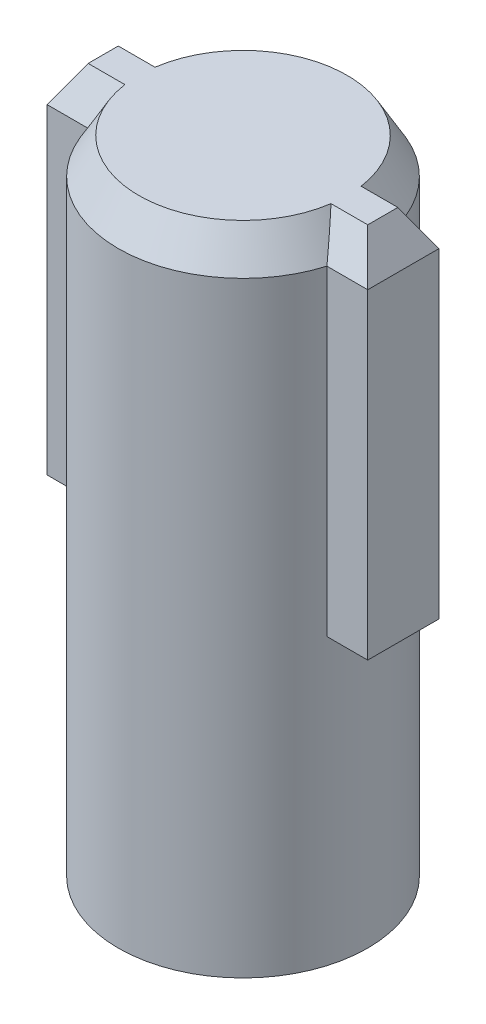
ISO-10303-21;
HEADER;
FILE_DESCRIPTION(('STEP AP214'),'2;1');
FILE_NAME('part.step','',(''),(''),'','','');
FILE_SCHEMA(('AUTOMOTIVE_DESIGN { 1 0 10303 214 1 1 1 1 }'));
ENDSEC;
DATA;
#1=APPLICATION_CONTEXT('core data for automotive mechanical design processes');
#2=APPLICATION_PROTOCOL_DEFINITION('international standard','automotive_design',2000,#1);
#3=PRODUCT_CONTEXT('',#1,'mechanical');
#4=PRODUCT('Part','Part','',(#3));
#5=PRODUCT_RELATED_PRODUCT_CATEGORY('part','',(#4));
#6=PRODUCT_DEFINITION_FORMATION('','',#4);
#7=PRODUCT_DEFINITION_CONTEXT('part definition',#1,'design');
#8=PRODUCT_DEFINITION('design','',#6,#7);
#9=PRODUCT_DEFINITION_SHAPE('','',#8);
#10=(LENGTH_UNIT() NAMED_UNIT(*) SI_UNIT(.MILLI.,.METRE.));
#11=(NAMED_UNIT(*) PLANE_ANGLE_UNIT() SI_UNIT($,.RADIAN.));
#12=(NAMED_UNIT(*) SI_UNIT($,.STERADIAN.) SOLID_ANGLE_UNIT());
#13=UNCERTAINTY_MEASURE_WITH_UNIT(LENGTH_MEASURE(1.E-05),#10,'distance_accuracy_value','');
#14=(GEOMETRIC_REPRESENTATION_CONTEXT(3) GLOBAL_UNCERTAINTY_ASSIGNED_CONTEXT((#13)) GLOBAL_UNIT_ASSIGNED_CONTEXT((#10,
#11,#12)) REPRESENTATION_CONTEXT('',''));
#15=CARTESIAN_POINT('',(0.,0.,0.));
#16=DIRECTION('',(0.,0.,1.));
#17=DIRECTION('',(1.,0.,0.));
#18=AXIS2_PLACEMENT_3D('',#15,#16,#17);
#19=CARTESIAN_POINT('',(0.,18.,0.));
#20=DIRECTION('',(0.,-1.,0.));
#21=DIRECTION('',(0.,0.,-1.));
#22=AXIS2_PLACEMENT_3D('',#19,#20,#21);
#23=CYLINDRICAL_SURFACE('',#22,3.5);
#24=DIRECTION('',(0.,-1.,0.));
#25=VECTOR('',#24,1.);
#26=CARTESIAN_POINT('',(-3.35410196624968,18.,-1.));
#27=LINE('',#26,#25);
#28=CARTESIAN_POINT('',(-3.35410196624968,12.,-1.));
#29=VERTEX_POINT('',#28);
#30=CARTESIAN_POINT('',(-3.35410196624968,17.,-1.));
#31=VERTEX_POINT('',#30);
#32=EDGE_CURVE('E186',#29,#31,#27,.F.);
#33=ORIENTED_EDGE('',*,*,#32,.T.);
#34=CARTESIAN_POINT('',(0.,17.,0.));
#35=DIRECTION('',(0.,1.,0.));
#36=DIRECTION('',(0.,0.,1.));
#37=AXIS2_PLACEMENT_3D('',#34,#35,#36);
#38=CIRCLE('',#37,3.5);
#39=CARTESIAN_POINT('',(3.35410196624968,17.,-1.));
#40=VERTEX_POINT('',#39);
#41=EDGE_CURVE('E219',#31,#40,#38,.F.);
#42=ORIENTED_EDGE('',*,*,#41,.T.);
#43=DIRECTION('',(0.,-1.,0.));
#44=VECTOR('',#43,1.);
#45=CARTESIAN_POINT('',(3.35410196624968,18.,-1.));
#46=LINE('',#45,#44);
#47=CARTESIAN_POINT('',(3.35410196624968,12.,-0.999999999999999));
#48=VERTEX_POINT('',#47);
#49=EDGE_CURVE('E189',#40,#48,#46,.T.);
#50=ORIENTED_EDGE('',*,*,#49,.T.);
#51=CARTESIAN_POINT('',(0.,12.,0.));
#52=DIRECTION('',(0.,-1.,0.));
#53=DIRECTION('',(0.,0.,-1.));
#54=AXIS2_PLACEMENT_3D('',#51,#52,#53);
#55=CIRCLE('',#54,3.5);
#56=EDGE_CURVE('E146',#29,#48,#55,.T.);
#57=ORIENTED_EDGE('',*,*,#56,.F.);
#58=EDGE_LOOP('',(#33,#42,#50,#57));
#59=FACE_BOUND('',#58,.T.);
#60=ADVANCED_FACE('F34',(#59),#23,.T.);
#61=DIRECTION('',(0.,-1.,0.));
#62=VECTOR('',#61,1.);
#63=CARTESIAN_POINT('',(3.35410196624968,18.,1.));
#64=LINE('',#63,#62);
#65=CARTESIAN_POINT('',(3.35410196624968,8.,1.));
#66=VERTEX_POINT('',#65);
#67=CARTESIAN_POINT('',(3.35410196624968,17.,1.));
#68=VERTEX_POINT('',#67);
#69=EDGE_CURVE('E180',#66,#68,#64,.F.);
#70=ORIENTED_EDGE('',*,*,#69,.T.);
#71=CARTESIAN_POINT('',(0.,17.,0.));
#72=DIRECTION('',(0.,1.,0.));
#73=DIRECTION('',(0.,0.,1.));
#74=AXIS2_PLACEMENT_3D('',#71,#72,#73);
#75=CIRCLE('',#74,3.5);
#76=CARTESIAN_POINT('',(-3.35410196624968,17.,1.));
#77=VERTEX_POINT('',#76);
#78=EDGE_CURVE('E11',#68,#77,#75,.F.);
#79=ORIENTED_EDGE('',*,*,#78,.T.);
#80=DIRECTION('',(0.,-1.,0.));
#81=VECTOR('',#80,1.);
#82=CARTESIAN_POINT('',(-3.35410196624968,18.,1.));
#83=LINE('',#82,#81);
#84=CARTESIAN_POINT('',(-3.35410196624968,8.,1.));
#85=VERTEX_POINT('',#84);
#86=EDGE_CURVE('E184',#77,#85,#83,.T.);
#87=ORIENTED_EDGE('',*,*,#86,.T.);
#88=CARTESIAN_POINT('',(0.,8.,0.));
#89=DIRECTION('',(0.,-1.,0.));
#90=DIRECTION('',(0.,0.,-1.));
#91=AXIS2_PLACEMENT_3D('',#88,#89,#90);
#92=CIRCLE('',#91,3.5);
#93=CARTESIAN_POINT('',(-3.35410196624968,8.,-1.));
#94=VERTEX_POINT('',#93);
#95=EDGE_CURVE('E143',#85,#94,#92,.T.);
#96=ORIENTED_EDGE('',*,*,#95,.T.);
#97=CARTESIAN_POINT('',(0.,8.,0.));
#98=DIRECTION('',(0.,-1.,0.));
#99=DIRECTION('',(0.,0.,-1.));
#100=AXIS2_PLACEMENT_3D('',#97,#98,#99);
#101=CIRCLE('',#100,3.5);
#102=CARTESIAN_POINT('',(3.35410196624968,8.,-0.999999999999999));
#103=VERTEX_POINT('',#102);
#104=EDGE_CURVE('E136',#94,#103,#101,.T.);
#105=ORIENTED_EDGE('',*,*,#104,.T.);
#106=EDGE_CURVE('E141',#103,#66,#92,.T.);
#107=ORIENTED_EDGE('',*,*,#106,.T.);
#108=EDGE_LOOP('',(#70,#79,#87,#96,#105,#107));
#109=FACE_BOUND('',#108,.T.);
#110=CARTESIAN_POINT('',(0.,0.,0.));
#111=DIRECTION('',(0.,1.,0.));
#112=DIRECTION('',(0.,0.,1.));
#113=AXIS2_PLACEMENT_3D('',#110,#111,#112);
#114=CIRCLE('',#113,3.5);
#115=CARTESIAN_POINT('',(0.,0.,3.5));
#116=VERTEX_POINT('',#115);
#117=EDGE_CURVE('E191',#116,#116,#114,.T.);
#118=ORIENTED_EDGE('',*,*,#117,.T.);
#119=EDGE_LOOP('',(#118));
#120=FACE_BOUND('',#119,.T.);
#121=ADVANCED_FACE('F138',(#109,#120),#23,.T.);
#122=CARTESIAN_POINT('',(0.,18.,0.));
#123=DIRECTION('',(0.,1.,0.));
#124=DIRECTION('',(0.,0.,1.));
#125=AXIS2_PLACEMENT_3D('',#122,#123,#124);
#126=PLANE('',#125);
#127=DIRECTION('',(0.,0.,1.));
#128=VECTOR('',#127,1.);
#129=CARTESIAN_POINT('',(-3.92264973081037,18.,0.));
#130=LINE('',#129,#128);
#131=CARTESIAN_POINT('',(-3.92264973081037,18.,-0.422649730810368));
#132=VERTEX_POINT('',#131);
#133=CARTESIAN_POINT('',(-3.92264973081037,18.,0.422649730810368));
#134=VERTEX_POINT('',#133);
#135=EDGE_CURVE('E205',#132,#134,#130,.T.);
#136=ORIENTED_EDGE('',*,*,#135,.T.);
#137=DIRECTION('',(1.,0.,0.));
#138=VECTOR('',#137,1.);
#139=CARTESIAN_POINT('',(0.,18.,0.422649730810368));
#140=LINE('',#139,#138);
#141=CARTESIAN_POINT('',(-2.891928189643,18.,0.422649730810362));
#142=VERTEX_POINT('',#141);
#143=EDGE_CURVE('E207',#134,#142,#140,.T.);
#144=ORIENTED_EDGE('',*,*,#143,.T.);
#145=CARTESIAN_POINT('',(0.,18.,0.));
#146=DIRECTION('',(0.,1.,0.));
#147=DIRECTION('',(0.,0.,1.));
#148=AXIS2_PLACEMENT_3D('',#145,#146,#147);
#149=CIRCLE('',#148,2.92264973081037);
#150=CARTESIAN_POINT('',(2.891928189643,18.,0.422649730810361));
#151=VERTEX_POINT('',#150);
#152=EDGE_CURVE('E162',#142,#151,#149,.T.);
#153=ORIENTED_EDGE('',*,*,#152,.T.);
#154=DIRECTION('',(1.,0.,0.));
#155=VECTOR('',#154,1.);
#156=CARTESIAN_POINT('',(0.,18.,0.422649730810368));
#157=LINE('',#156,#155);
#158=CARTESIAN_POINT('',(3.92264973081037,18.,0.422649730810367));
#159=VERTEX_POINT('',#158);
#160=EDGE_CURVE('E195',#151,#159,#157,.T.);
#161=ORIENTED_EDGE('',*,*,#160,.T.);
#162=DIRECTION('',(0.,0.,-1.));
#163=VECTOR('',#162,1.);
#164=CARTESIAN_POINT('',(3.92264973081037,18.,0.));
#165=LINE('',#164,#163);
#166=CARTESIAN_POINT('',(3.92264973081037,18.,-0.422649730810369));
#167=VERTEX_POINT('',#166);
#168=EDGE_CURVE('E197',#159,#167,#165,.T.);
#169=ORIENTED_EDGE('',*,*,#168,.T.);
#170=DIRECTION('',(-1.,0.,0.));
#171=VECTOR('',#170,1.);
#172=CARTESIAN_POINT('',(0.,18.,-0.422649730810368));
#173=LINE('',#172,#171);
#174=CARTESIAN_POINT('',(2.891928189643,18.,-0.422649730810369));
#175=VERTEX_POINT('',#174);
#176=EDGE_CURVE('E199',#167,#175,#173,.T.);
#177=ORIENTED_EDGE('',*,*,#176,.T.);
#178=CARTESIAN_POINT('',(0.,18.,0.));
#179=DIRECTION('',(0.,1.,0.));
#180=DIRECTION('',(0.,0.,1.));
#181=AXIS2_PLACEMENT_3D('',#178,#179,#180);
#182=CIRCLE('',#181,2.92264973081037);
#183=CARTESIAN_POINT('',(-2.891928189643,18.,-0.422649730810361));
#184=VERTEX_POINT('',#183);
#185=EDGE_CURVE('E201',#175,#184,#182,.T.);
#186=ORIENTED_EDGE('',*,*,#185,.T.);
#187=DIRECTION('',(-1.,0.,0.));
#188=VECTOR('',#187,1.);
#189=CARTESIAN_POINT('',(0.,18.,-0.422649730810368));
#190=LINE('',#189,#188);
#191=EDGE_CURVE('E203',#184,#132,#190,.T.);
#192=ORIENTED_EDGE('',*,*,#191,.T.);
#193=EDGE_LOOP('',(#136,#144,#153,#161,#169,#177,#186,#192));
#194=FACE_BOUND('',#193,.T.);
#195=ADVANCED_FACE('F284',(#194),#126,.T.);
#196=CARTESIAN_POINT('',(0.,0.,0.));
#197=DIRECTION('',(0.,1.,0.));
#198=DIRECTION('',(0.,0.,1.));
#199=AXIS2_PLACEMENT_3D('',#196,#197,#198);
#200=PLANE('',#199);
#201=ORIENTED_EDGE('',*,*,#117,.F.);
#202=EDGE_LOOP('',(#201));
#203=FACE_BOUND('',#202,.T.);
#204=ADVANCED_FACE('F286',(#203),#200,.F.);
#205=CARTESIAN_POINT('',(-4.5,8.,-1.));
#206=DIRECTION('',(-1.,0.,0.));
#207=DIRECTION('',(0.,0.,1.));
#208=AXIS2_PLACEMENT_3D('',#205,#206,#207);
#209=PLANE('',#208);
#210=DIRECTION('',(0.,1.,0.));
#211=VECTOR('',#210,1.);
#212=CARTESIAN_POINT('',(-4.5,8.,1.));
#213=LINE('',#212,#211);
#214=CARTESIAN_POINT('',(-4.5,8.,1.));
#215=VERTEX_POINT('',#214);
#216=CARTESIAN_POINT('',(-4.5,17.,1.));
#217=VERTEX_POINT('',#216);
#218=EDGE_CURVE('E168',#215,#217,#213,.T.);
#219=ORIENTED_EDGE('',*,*,#218,.T.);
#220=DIRECTION('',(0.,0.,-1.));
#221=VECTOR('',#220,1.);
#222=CARTESIAN_POINT('',(-4.5,17.,-1.));
#223=LINE('',#222,#221);
#224=CARTESIAN_POINT('',(-4.5,17.,-1.));
#225=VERTEX_POINT('',#224);
#226=EDGE_CURVE('E213',#217,#225,#223,.T.);
#227=ORIENTED_EDGE('',*,*,#226,.T.);
#228=DIRECTION('',(0.,1.,0.));
#229=VECTOR('',#228,1.);
#230=CARTESIAN_POINT('',(-4.5,8.,-1.));
#231=LINE('',#230,#229);
#232=CARTESIAN_POINT('',(-4.5,8.,-1.));
#233=VERTEX_POINT('',#232);
#234=EDGE_CURVE('E178',#233,#225,#231,.T.);
#235=ORIENTED_EDGE('',*,*,#234,.F.);
#236=DIRECTION('',(0.,0.,1.));
#237=VECTOR('',#236,1.);
#238=CARTESIAN_POINT('',(-4.5,8.,-1.));
#239=LINE('',#238,#237);
#240=EDGE_CURVE('E322',#233,#215,#239,.T.);
#241=ORIENTED_EDGE('',*,*,#240,.T.);
#242=EDGE_LOOP('',(#219,#227,#235,#241));
#243=FACE_BOUND('',#242,.T.);
#244=ADVANCED_FACE('F289',(#243),#209,.T.);
#245=CARTESIAN_POINT('',(0.,8.,0.));
#246=DIRECTION('',(0.,-1.,0.));
#247=DIRECTION('',(0.,0.,-1.));
#248=AXIS2_PLACEMENT_3D('',#245,#246,#247);
#249=PLANE('',#248);
#250=ORIENTED_EDGE('',*,*,#95,.F.);
#251=DIRECTION('',(1.,0.,0.));
#252=VECTOR('',#251,1.);
#253=CARTESIAN_POINT('',(4.5,8.,0.999999999999999));
#254=LINE('',#253,#252);
#255=EDGE_CURVE('E329',#215,#85,#254,.T.);
#256=ORIENTED_EDGE('',*,*,#255,.F.);
#257=ORIENTED_EDGE('',*,*,#240,.F.);
#258=DIRECTION('',(-1.,0.,0.));
#259=VECTOR('',#258,1.);
#260=CARTESIAN_POINT('',(4.5,8.,-1.));
#261=LINE('',#260,#259);
#262=EDGE_CURVE('E169',#94,#233,#261,.T.);
#263=ORIENTED_EDGE('',*,*,#262,.F.);
#264=EDGE_LOOP('',(#250,#256,#257,#263));
#265=FACE_BOUND('',#264,.T.);
#266=ADVANCED_FACE('F296',(#265),#249,.T.);
#267=CARTESIAN_POINT('',(4.5,8.,0.999999999999999));
#268=DIRECTION('',(0.,0.,1.));
#269=DIRECTION('',(1.,0.,0.));
#270=AXIS2_PLACEMENT_3D('',#267,#268,#269);
#271=PLANE('',#270);
#272=ORIENTED_EDGE('',*,*,#86,.F.);
#273=DIRECTION('',(-1.,0.,0.));
#274=VECTOR('',#273,1.);
#275=CARTESIAN_POINT('',(4.5,17.,0.999999999999999));
#276=LINE('',#275,#274);
#277=EDGE_CURVE('E210',#77,#217,#276,.T.);
#278=ORIENTED_EDGE('',*,*,#277,.T.);
#279=ORIENTED_EDGE('',*,*,#218,.F.);
#280=ORIENTED_EDGE('',*,*,#255,.T.);
#281=EDGE_LOOP('',(#272,#278,#279,#280));
#282=FACE_BOUND('',#281,.T.);
#283=ADVANCED_FACE('F298',(#282),#271,.T.);
#284=ORIENTED_EDGE('',*,*,#106,.F.);
#285=CARTESIAN_POINT('',(4.5,8.,-1.));
#286=VERTEX_POINT('',#285);
#287=EDGE_CURVE('E160',#286,#103,#261,.T.);
#288=ORIENTED_EDGE('',*,*,#287,.F.);
#289=DIRECTION('',(0.,0.,-1.));
#290=VECTOR('',#289,1.);
#291=CARTESIAN_POINT('',(4.5,8.,-1.));
#292=LINE('',#291,#290);
#293=CARTESIAN_POINT('',(4.5,8.,0.999999999999999));
#294=VERTEX_POINT('',#293);
#295=EDGE_CURVE('E174',#294,#286,#292,.T.);
#296=ORIENTED_EDGE('',*,*,#295,.F.);
#297=EDGE_CURVE('E161',#66,#294,#254,.T.);
#298=ORIENTED_EDGE('',*,*,#297,.F.);
#299=EDGE_LOOP('',(#284,#288,#296,#298));
#300=FACE_BOUND('',#299,.T.);
#301=ADVANCED_FACE('F158',(#300),#249,.T.);
#302=CARTESIAN_POINT('',(4.5,8.,-1.));
#303=DIRECTION('',(0.,0.,-1.));
#304=DIRECTION('',(-1.,0.,0.));
#305=AXIS2_PLACEMENT_3D('',#302,#303,#304);
#306=PLANE('',#305);
#307=ORIENTED_EDGE('',*,*,#234,.T.);
#308=DIRECTION('',(1.,0.,0.));
#309=VECTOR('',#308,1.);
#310=CARTESIAN_POINT('',(4.5,17.,-1.));
#311=LINE('',#310,#309);
#312=EDGE_CURVE('E217',#225,#31,#311,.T.);
#313=ORIENTED_EDGE('',*,*,#312,.T.);
#314=ORIENTED_EDGE('',*,*,#32,.F.);
#315=DIRECTION('',(-1.,0.,0.));
#316=VECTOR('',#315,1.);
#317=CARTESIAN_POINT('',(-5.,12.,-1.));
#318=LINE('',#317,#316);
#319=EDGE_CURVE('E147',#48,#29,#318,.T.);
#320=ORIENTED_EDGE('',*,*,#319,.F.);
#321=ORIENTED_EDGE('',*,*,#49,.F.);
#322=DIRECTION('',(1.,0.,0.));
#323=VECTOR('',#322,1.);
#324=CARTESIAN_POINT('',(4.5,17.,-1.));
#325=LINE('',#324,#323);
#326=CARTESIAN_POINT('',(4.5,17.,-1.));
#327=VERTEX_POINT('',#326);
#328=EDGE_CURVE('E215',#40,#327,#325,.T.);
#329=ORIENTED_EDGE('',*,*,#328,.T.);
#330=DIRECTION('',(0.,1.,0.));
#331=VECTOR('',#330,1.);
#332=CARTESIAN_POINT('',(4.5,8.,-1.));
#333=LINE('',#332,#331);
#334=EDGE_CURVE('E166',#286,#327,#333,.T.);
#335=ORIENTED_EDGE('',*,*,#334,.F.);
#336=ORIENTED_EDGE('',*,*,#287,.T.);
#337=DIRECTION('',(-1.,0.,0.));
#338=VECTOR('',#337,1.);
#339=CARTESIAN_POINT('',(-5.,8.,-1.));
#340=LINE('',#339,#338);
#341=EDGE_CURVE('E149',#103,#94,#340,.T.);
#342=ORIENTED_EDGE('',*,*,#341,.T.);
#343=ORIENTED_EDGE('',*,*,#262,.T.);
#344=EDGE_LOOP('',(#307,#313,#314,#320,#321,#329,#335,#336,#342,#343));
#345=FACE_BOUND('',#344,.T.);
#346=ADVANCED_FACE('F165',(#345),#306,.T.);
#347=DIRECTION('',(0.,1.,0.));
#348=VECTOR('',#347,1.);
#349=CARTESIAN_POINT('',(4.5,8.,0.999999999999999));
#350=LINE('',#349,#348);
#351=CARTESIAN_POINT('',(4.5,17.,0.999999999999999));
#352=VERTEX_POINT('',#351);
#353=EDGE_CURVE('E172',#294,#352,#350,.T.);
#354=ORIENTED_EDGE('',*,*,#353,.T.);
#355=DIRECTION('',(-1.,0.,0.));
#356=VECTOR('',#355,1.);
#357=CARTESIAN_POINT('',(4.5,17.,0.999999999999999));
#358=LINE('',#357,#356);
#359=EDGE_CURVE('E48',#352,#68,#358,.T.);
#360=ORIENTED_EDGE('',*,*,#359,.T.);
#361=ORIENTED_EDGE('',*,*,#69,.F.);
#362=ORIENTED_EDGE('',*,*,#297,.T.);
#363=EDGE_LOOP('',(#354,#360,#361,#362));
#364=FACE_BOUND('',#363,.T.);
#365=ADVANCED_FACE('F302',(#364),#271,.T.);
#366=CARTESIAN_POINT('',(4.5,8.,-1.));
#367=DIRECTION('',(1.,0.,0.));
#368=DIRECTION('',(0.,0.,-1.));
#369=AXIS2_PLACEMENT_3D('',#366,#367,#368);
#370=PLANE('',#369);
#371=ORIENTED_EDGE('',*,*,#334,.T.);
#372=DIRECTION('',(0.,0.,1.));
#373=VECTOR('',#372,1.);
#374=CARTESIAN_POINT('',(4.5,17.,-1.));
#375=LINE('',#374,#373);
#376=EDGE_CURVE('E63',#327,#352,#375,.T.);
#377=ORIENTED_EDGE('',*,*,#376,.T.);
#378=ORIENTED_EDGE('',*,*,#353,.F.);
#379=ORIENTED_EDGE('',*,*,#295,.T.);
#380=EDGE_LOOP('',(#371,#377,#378,#379));
#381=FACE_BOUND('',#380,.T.);
#382=ADVANCED_FACE('F303',(#381),#370,.T.);
#383=CARTESIAN_POINT('',(0.,12.,0.));
#384=DIRECTION('',(0.,-1.,0.));
#385=DIRECTION('',(0.,0.,-1.));
#386=AXIS2_PLACEMENT_3D('',#383,#384,#385);
#387=PLANE('',#386);
#388=ORIENTED_EDGE('',*,*,#56,.T.);
#389=ORIENTED_EDGE('',*,*,#319,.T.);
#390=EDGE_LOOP('',(#388,#389));
#391=FACE_BOUND('',#390,.T.);
#392=ADVANCED_FACE('F306',(#391),#387,.T.);
#393=CARTESIAN_POINT('',(0.,8.,0.));
#394=DIRECTION('',(0.,-1.,0.));
#395=DIRECTION('',(0.,0.,-1.));
#396=AXIS2_PLACEMENT_3D('',#393,#394,#395);
#397=PLANE('',#396);
#398=ORIENTED_EDGE('',*,*,#104,.F.);
#399=ORIENTED_EDGE('',*,*,#341,.F.);
#400=EDGE_LOOP('',(#398,#399));
#401=FACE_BOUND('',#400,.T.);
#402=ADVANCED_FACE('F150',(#401),#397,.F.);
#403=CARTESIAN_POINT('',(0.,18.,-0.422649730810368));
#404=DIRECTION('',(0.,-0.499999999999998,0.86602540378444));
#405=DIRECTION('',(-1.,0.,0.));
#406=AXIS2_PLACEMENT_3D('',#403,#404,#405);
#407=PLANE('',#406);
#408=DIRECTION('',(-0.447213595499956,0.774596669241485,0.447213595499957));
#409=VECTOR('',#408,1.);
#410=CARTESIAN_POINT('',(3.83811978464829,18.1464101615138,-0.338119784648296));
#411=LINE('',#410,#409);
#412=EDGE_CURVE('E263',#327,#167,#411,.T.);
#413=ORIENTED_EDGE('',*,*,#412,.F.);
#414=ORIENTED_EDGE('',*,*,#328,.F.);
#415=CARTESIAN_POINT('',(3.35410196624968,17.,-1.));
#416=CARTESIAN_POINT('',(3.31789876279821,17.0841225359634,-0.951431831216601));
#417=CARTESIAN_POINT('',(3.28118510315563,17.1680814693473,-0.902958118426541));
#418=CARTESIAN_POINT('',(3.20664393840968,17.3356117830366,-0.806234446720612));
#419=CARTESIAN_POINT('',(3.16881661552825,17.4191832241831,-0.757984452678081));
#420=CARTESIAN_POINT('',(3.09194204926259,17.5859087019816,-0.661725453190358));
#421=CARTESIAN_POINT('',(3.05289476073218,17.669062723054,-0.613716456740038));
#422=CARTESIAN_POINT('',(2.97345206026992,17.8349019365773,-0.517969142170157));
#423=CARTESIAN_POINT('',(2.93305642980277,17.9175870504635,-0.470230869409975));
#424=CARTESIAN_POINT('',(2.891928189643,18.,-0.422649730810368));
#425=B_SPLINE_CURVE_WITH_KNOTS('',3,(#415,#416,#417,#418,#419,#420,#421,#422,#423,#424),
.UNSPECIFIED.,.F.,.F.,(4,2,2,2,4),(0.,0.310991130380704,0.621931654926695,0.932883699835558,
1.24388639002683),.UNSPECIFIED.);
#426=EDGE_CURVE('E39',#175,#40,#425,.F.);
#427=ORIENTED_EDGE('',*,*,#426,.F.);
#428=ORIENTED_EDGE('',*,*,#176,.F.);
#429=EDGE_LOOP('',(#413,#414,#427,#428));
#430=FACE_BOUND('',#429,.T.);
#431=ADVANCED_FACE('F36',(#430),#407,.F.);
#432=CARTESIAN_POINT('',(0.,18.,0.));
#433=DIRECTION('',(0.,-1.,0.));
#434=DIRECTION('',(0.,0.,-1.));
#435=AXIS2_PLACEMENT_3D('',#432,#433,#434);
#436=CONICAL_SURFACE('',#435,2.92264973081037,0.523598775598297);
#437=ORIENTED_EDGE('',*,*,#426,.T.);
#438=ORIENTED_EDGE('',*,*,#41,.F.);
#439=CARTESIAN_POINT('',(-3.35410196624968,17.,-1.));
#440=CARTESIAN_POINT('',(-3.31789876279821,17.0841225359634,-0.951431831216601));
#441=CARTESIAN_POINT('',(-3.28118510315563,17.1680814693473,-0.902958118426541));
#442=CARTESIAN_POINT('',(-3.20664393840968,17.3356117830366,-0.806234446720613));
#443=CARTESIAN_POINT('',(-3.16881661552825,17.4191832241831,-0.757984452678084));
#444=CARTESIAN_POINT('',(-3.0919420492626,17.5859087019816,-0.661725453190362));
#445=CARTESIAN_POINT('',(-3.05289476073218,17.669062723054,-0.613716456740043));
#446=CARTESIAN_POINT('',(-2.97345206026993,17.8349019365773,-0.517969142170163));
#447=CARTESIAN_POINT('',(-2.93305642980278,17.9175870504635,-0.470230869409981));
#448=CARTESIAN_POINT('',(-2.89192818964301,18.,-0.422649730810376));
#449=B_SPLINE_CURVE_WITH_KNOTS('',3,(#439,#440,#441,#442,#443,#444,#445,#446,#447,#448),
.UNSPECIFIED.,.F.,.F.,(4,2,2,2,4),(0.,0.310991130380704,0.621931654926687,0.932883699835545,
1.24388639002681),.UNSPECIFIED.);
#450=EDGE_CURVE('E257',#184,#31,#449,.F.);
#451=ORIENTED_EDGE('',*,*,#450,.F.);
#452=ORIENTED_EDGE('',*,*,#185,.F.);
#453=EDGE_LOOP('',(#437,#438,#451,#452));
#454=FACE_BOUND('',#453,.T.);
#455=ADVANCED_FACE('F266',(#454),#436,.T.);
#456=CARTESIAN_POINT('',(3.92264973081037,18.,0.));
#457=DIRECTION('',(-0.86602540378444,-0.499999999999998,0.));
#458=DIRECTION('',(0.,0.,-1.));
#459=AXIS2_PLACEMENT_3D('',#456,#457,#458);
#460=PLANE('',#459);
#461=ORIENTED_EDGE('',*,*,#412,.T.);
#462=ORIENTED_EDGE('',*,*,#168,.F.);
#463=DIRECTION('',(-0.447213595499956,0.774596669241485,-0.447213595499957));
#464=VECTOR('',#463,1.);
#465=CARTESIAN_POINT('',(3.1381197846483,19.358845726812,-0.361880215351702));
#466=LINE('',#465,#464);
#467=EDGE_CURVE('E254',#352,#159,#466,.T.);
#468=ORIENTED_EDGE('',*,*,#467,.F.);
#469=ORIENTED_EDGE('',*,*,#376,.F.);
#470=EDGE_LOOP('',(#461,#462,#468,#469));
#471=FACE_BOUND('',#470,.T.);
#472=ADVANCED_FACE('F269',(#471),#460,.F.);
#473=CARTESIAN_POINT('',(0.,18.,-0.422649730810368));
#474=DIRECTION('',(0.,-0.499999999999999,0.86602540378444));
#475=DIRECTION('',(-1.,0.,0.));
#476=AXIS2_PLACEMENT_3D('',#473,#474,#475);
#477=PLANE('',#476);
#478=ORIENTED_EDGE('',*,*,#450,.T.);
#479=ORIENTED_EDGE('',*,*,#312,.F.);
#480=DIRECTION('',(0.447213595499956,0.774596669241485,0.447213595499957));
#481=VECTOR('',#480,1.);
#482=CARTESIAN_POINT('',(-3.1381197846483,19.358845726812,0.361880215351701));
#483=LINE('',#482,#481);
#484=EDGE_CURVE('E251',#132,#225,#483,.F.);
#485=ORIENTED_EDGE('',*,*,#484,.F.);
#486=ORIENTED_EDGE('',*,*,#191,.F.);
#487=EDGE_LOOP('',(#478,#479,#485,#486));
#488=FACE_BOUND('',#487,.T.);
#489=ADVANCED_FACE('F264',(#488),#477,.F.);
#490=CARTESIAN_POINT('',(0.,18.,0.422649730810368));
#491=DIRECTION('',(0.,-0.499999999999999,-0.86602540378444));
#492=DIRECTION('',(1.,0.,0.));
#493=AXIS2_PLACEMENT_3D('',#490,#491,#492);
#494=PLANE('',#493);
#495=ORIENTED_EDGE('',*,*,#467,.T.);
#496=ORIENTED_EDGE('',*,*,#160,.F.);
#497=CARTESIAN_POINT('',(3.35410196624968,17.,1.));
#498=CARTESIAN_POINT('',(3.31789876279821,17.0841225359634,0.9514318312166));
#499=CARTESIAN_POINT('',(3.28118510315563,17.1680814693473,0.90295811842654));
#500=CARTESIAN_POINT('',(3.20664393840968,17.3356117830366,0.806234446720612));
#501=CARTESIAN_POINT('',(3.16881661552825,17.4191832241831,0.757984452678083));
#502=CARTESIAN_POINT('',(3.0919420492626,17.5859087019816,0.661725453190361));
#503=CARTESIAN_POINT('',(3.05289476073218,17.669062723054,0.613716456740042));
#504=CARTESIAN_POINT('',(2.97345206026993,17.8349019365773,0.517969142170163));
#505=CARTESIAN_POINT('',(2.93305642980278,17.9175870504635,0.470230869409981));
#506=CARTESIAN_POINT('',(2.89192818964301,18.,0.422649730810375));
#507=B_SPLINE_CURVE_WITH_KNOTS('',3,(#497,#498,#499,#500,#501,#502,#503,#504,#505,#506),
.UNSPECIFIED.,.F.,.F.,(4,2,2,2,4),(0.,0.310991130380704,0.621931654926687,0.932883699835545,
1.24388639002681),.UNSPECIFIED.);
#508=EDGE_CURVE('E245',#68,#151,#507,.T.);
#509=ORIENTED_EDGE('',*,*,#508,.F.);
#510=ORIENTED_EDGE('',*,*,#359,.F.);
#511=EDGE_LOOP('',(#495,#496,#509,#510));
#512=FACE_BOUND('',#511,.T.);
#513=ADVANCED_FACE('F241',(#512),#494,.F.);
#514=CARTESIAN_POINT('',(-3.92264973081037,18.,0.));
#515=DIRECTION('',(0.86602540378444,-0.499999999999998,0.));
#516=DIRECTION('',(0.,0.,1.));
#517=AXIS2_PLACEMENT_3D('',#514,#515,#516);
#518=PLANE('',#517);
#519=ORIENTED_EDGE('',*,*,#484,.T.);
#520=ORIENTED_EDGE('',*,*,#226,.F.);
#521=DIRECTION('',(0.447213595499956,0.774596669241485,-0.447213595499957));
#522=VECTOR('',#521,1.);
#523=CARTESIAN_POINT('',(-3.8381197846483,18.1464101615138,0.338119784648296));
#524=LINE('',#523,#522);
#525=EDGE_CURVE('E230',#134,#217,#524,.F.);
#526=ORIENTED_EDGE('',*,*,#525,.F.);
#527=ORIENTED_EDGE('',*,*,#135,.F.);
#528=EDGE_LOOP('',(#519,#520,#526,#527));
#529=FACE_BOUND('',#528,.T.);
#530=ADVANCED_FACE('F239',(#529),#518,.F.);
#531=CARTESIAN_POINT('',(0.,18.,0.));
#532=DIRECTION('',(0.,-1.,0.));
#533=DIRECTION('',(0.,0.,-1.));
#534=AXIS2_PLACEMENT_3D('',#531,#532,#533);
#535=CONICAL_SURFACE('',#534,2.92264973081037,0.523598775598297);
#536=ORIENTED_EDGE('',*,*,#508,.T.);
#537=ORIENTED_EDGE('',*,*,#152,.F.);
#538=CARTESIAN_POINT('',(-2.89192818964305,18.,0.422649730810368));
#539=CARTESIAN_POINT('',(-2.93305642980279,17.9175870504635,0.470230869409978));
#540=CARTESIAN_POINT('',(-2.97345206026993,17.8349019365773,0.517969142170162));
#541=CARTESIAN_POINT('',(-3.05289476073218,17.669062723054,0.613716456740043));
#542=CARTESIAN_POINT('',(-3.0919420492626,17.5859087019816,0.661725453190362));
#543=CARTESIAN_POINT('',(-3.16881661552825,17.4191832241831,0.757984452678084));
#544=CARTESIAN_POINT('',(-3.20664393840968,17.3356117830366,0.806234446720614));
#545=CARTESIAN_POINT('',(-3.28118510315563,17.1680814693473,0.902958118426542));
#546=CARTESIAN_POINT('',(-3.31789876279821,17.0841225359634,0.951431831216602));
#547=CARTESIAN_POINT('',(-3.35410196624968,17.,1.));
#548=B_SPLINE_CURVE_WITH_KNOTS('',3,(#538,#539,#540,#541,#542,#543,#544,#545,#546,#547),
.UNSPECIFIED.,.F.,.F.,(4,2,2,2,4),(0.,0.311002690191268,0.621954735100127,0.932895259646115,
1.24388639002681),.UNSPECIFIED.);
#549=EDGE_CURVE('E223',#77,#142,#548,.F.);
#550=ORIENTED_EDGE('',*,*,#549,.F.);
#551=ORIENTED_EDGE('',*,*,#78,.F.);
#552=EDGE_LOOP('',(#536,#537,#550,#551));
#553=FACE_BOUND('',#552,.T.);
#554=ADVANCED_FACE('F235',(#553),#535,.T.);
#555=CARTESIAN_POINT('',(0.,18.,0.422649730810368));
#556=DIRECTION('',(0.,-0.499999999999998,-0.86602540378444));
#557=DIRECTION('',(1.,0.,0.));
#558=AXIS2_PLACEMENT_3D('',#555,#556,#557);
#559=PLANE('',#558);
#560=ORIENTED_EDGE('',*,*,#525,.T.);
#561=ORIENTED_EDGE('',*,*,#277,.F.);
#562=ORIENTED_EDGE('',*,*,#549,.T.);
#563=ORIENTED_EDGE('',*,*,#143,.F.);
#564=EDGE_LOOP('',(#560,#561,#562,#563));
#565=FACE_BOUND('',#564,.T.);
#566=ADVANCED_FACE('F232',(#565),#559,.F.);
#567=CLOSED_SHELL('',(#60,#121,#195,#204,#244,#266,#283,#301,#346,#365,#382,#392,#402,#431,#455,
#472,#489,#513,#530,#554,#566));
#568=MANIFOLD_SOLID_BREP('B2',#567);
#569=ADVANCED_BREP_SHAPE_REPRESENTATION('',(#18,#568),#14);
#570=SHAPE_DEFINITION_REPRESENTATION(#9,#569);
ENDSEC;
END-ISO-10303-21;
